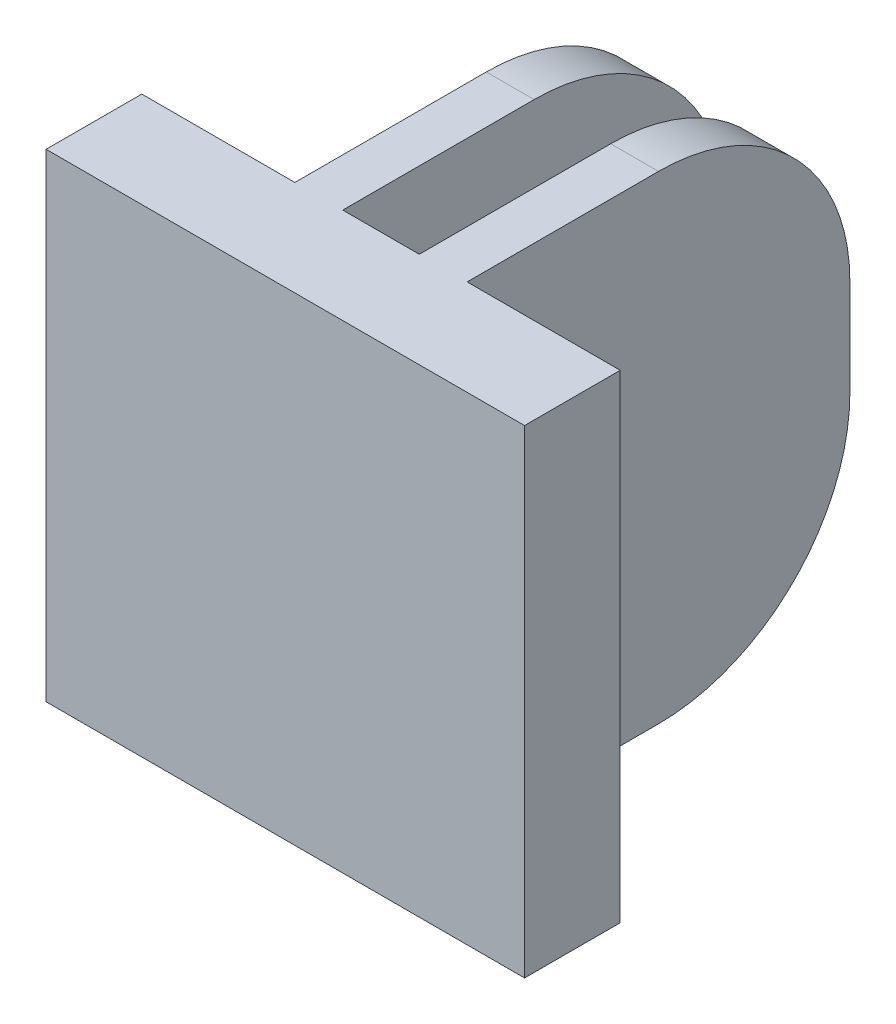
ISO-10303-21;
HEADER;
FILE_DESCRIPTION(('STEP AP214'),'2;1');
FILE_NAME('part.step','',(''),(''),'','','');
FILE_SCHEMA(('AUTOMOTIVE_DESIGN { 1 0 10303 214 1 1 1 1 }'));
ENDSEC;
DATA;
#1=APPLICATION_CONTEXT('core data for automotive mechanical design processes');
#2=APPLICATION_PROTOCOL_DEFINITION('international standard','automotive_design',2000,#1);
#3=PRODUCT_CONTEXT('',#1,'mechanical');
#4=PRODUCT('Part','Part','',(#3));
#5=PRODUCT_RELATED_PRODUCT_CATEGORY('part','',(#4));
#6=PRODUCT_DEFINITION_FORMATION('','',#4);
#7=PRODUCT_DEFINITION_CONTEXT('part definition',#1,'design');
#8=PRODUCT_DEFINITION('design','',#6,#7);
#9=PRODUCT_DEFINITION_SHAPE('','',#8);
#10=(LENGTH_UNIT() NAMED_UNIT(*) SI_UNIT(.MILLI.,.METRE.));
#11=(NAMED_UNIT(*) PLANE_ANGLE_UNIT() SI_UNIT($,.RADIAN.));
#12=(NAMED_UNIT(*) SI_UNIT($,.STERADIAN.) SOLID_ANGLE_UNIT());
#13=UNCERTAINTY_MEASURE_WITH_UNIT(LENGTH_MEASURE(1.E-05),#10,'distance_accuracy_value','');
#14=(GEOMETRIC_REPRESENTATION_CONTEXT(3) GLOBAL_UNCERTAINTY_ASSIGNED_CONTEXT((#13)) GLOBAL_UNIT_ASSIGNED_CONTEXT((#10,
#11,#12)) REPRESENTATION_CONTEXT('',''));
#15=CARTESIAN_POINT('',(0.,0.,0.));
#16=DIRECTION('',(0.,0.,1.));
#17=DIRECTION('',(1.,0.,0.));
#18=AXIS2_PLACEMENT_3D('',#15,#16,#17);
#19=CARTESIAN_POINT('',(-25.,25.,10.));
#20=DIRECTION('',(0.,-1.,0.));
#21=DIRECTION('',(0.,0.,-1.));
#22=AXIS2_PLACEMENT_3D('',#19,#20,#21);
#23=PLANE('',#22);
#24=DIRECTION('',(0.,0.,-1.));
#25=VECTOR('',#24,1.);
#26=CARTESIAN_POINT('',(-25.,25.,10.));
#27=LINE('',#26,#25);
#28=CARTESIAN_POINT('',(-25.,25.,10.));
#29=VERTEX_POINT('',#28);
#30=CARTESIAN_POINT('',(-25.,25.,0.));
#31=VERTEX_POINT('',#30);
#32=EDGE_CURVE('E251',#29,#31,#27,.T.);
#33=ORIENTED_EDGE('',*,*,#32,.F.);
#34=DIRECTION('',(-1.,0.,0.));
#35=VECTOR('',#34,1.);
#36=CARTESIAN_POINT('',(-25.,25.,10.));
#37=LINE('',#36,#35);
#38=CARTESIAN_POINT('',(25.,25.,10.));
#39=VERTEX_POINT('',#38);
#40=EDGE_CURVE('E225',#39,#29,#37,.T.);
#41=ORIENTED_EDGE('',*,*,#40,.F.);
#42=DIRECTION('',(0.,0.,-1.));
#43=VECTOR('',#42,1.);
#44=CARTESIAN_POINT('',(25.,25.,10.));
#45=LINE('',#44,#43);
#46=CARTESIAN_POINT('',(25.,25.,0.));
#47=VERTEX_POINT('',#46);
#48=EDGE_CURVE('E254',#39,#47,#45,.T.);
#49=ORIENTED_EDGE('',*,*,#48,.T.);
#50=DIRECTION('',(-1.,0.,0.));
#51=VECTOR('',#50,1.);
#52=CARTESIAN_POINT('',(-25.,25.,0.));
#53=LINE('',#52,#51);
#54=CARTESIAN_POINT('',(9.,25.,0.));
#55=VERTEX_POINT('',#54);
#56=EDGE_CURVE('E236',#47,#55,#53,.T.);
#57=ORIENTED_EDGE('',*,*,#56,.T.);
#58=DIRECTION('',(0.,0.,1.));
#59=VECTOR('',#58,1.);
#60=CARTESIAN_POINT('',(9.,25.,-40.));
#61=LINE('',#60,#59);
#62=CARTESIAN_POINT('',(9.,25.,-19.9999999999999));
#63=VERTEX_POINT('',#62);
#64=EDGE_CURVE('E214',#63,#55,#61,.T.);
#65=ORIENTED_EDGE('',*,*,#64,.F.);
#66=DIRECTION('',(1.,0.,0.));
#67=VECTOR('',#66,1.);
#68=CARTESIAN_POINT('',(-31.,25.,-19.9999999999999));
#69=LINE('',#68,#67);
#70=CARTESIAN_POINT('',(4.,25.,-19.9999999999999));
#71=VERTEX_POINT('',#70);
#72=EDGE_CURVE('E313',#71,#63,#69,.T.);
#73=ORIENTED_EDGE('',*,*,#72,.F.);
#74=DIRECTION('',(0.,0.,1.));
#75=VECTOR('',#74,1.);
#76=CARTESIAN_POINT('',(4.,25.,-40.));
#77=LINE('',#76,#75);
#78=CARTESIAN_POINT('',(4.,25.,0.));
#79=VERTEX_POINT('',#78);
#80=EDGE_CURVE('E218',#71,#79,#77,.T.);
#81=ORIENTED_EDGE('',*,*,#80,.T.);
#82=CARTESIAN_POINT('',(-4.,25.,0.));
#83=VERTEX_POINT('',#82);
#84=EDGE_CURVE('E240',#79,#83,#53,.T.);
#85=ORIENTED_EDGE('',*,*,#84,.T.);
#86=DIRECTION('',(0.,0.,1.));
#87=VECTOR('',#86,1.);
#88=CARTESIAN_POINT('',(-4.,25.,-40.));
#89=LINE('',#88,#87);
#90=CARTESIAN_POINT('',(-4.,25.,-19.9999999999999));
#91=VERTEX_POINT('',#90);
#92=EDGE_CURVE('E281',#91,#83,#89,.T.);
#93=ORIENTED_EDGE('',*,*,#92,.F.);
#94=CARTESIAN_POINT('',(-9.00000000000001,25.,-19.9999999999999));
#95=VERTEX_POINT('',#94);
#96=EDGE_CURVE('E351',#95,#91,#69,.T.);
#97=ORIENTED_EDGE('',*,*,#96,.F.);
#98=DIRECTION('',(0.,0.,1.));
#99=VECTOR('',#98,1.);
#100=CARTESIAN_POINT('',(-9.00000000000001,25.,-40.));
#101=LINE('',#100,#99);
#102=CARTESIAN_POINT('',(-9.00000000000001,25.,0.));
#103=VERTEX_POINT('',#102);
#104=EDGE_CURVE('E292',#95,#103,#101,.T.);
#105=ORIENTED_EDGE('',*,*,#104,.T.);
#106=EDGE_CURVE('E235',#103,#31,#53,.T.);
#107=ORIENTED_EDGE('',*,*,#106,.T.);
#108=EDGE_LOOP('',(#33,#41,#49,#57,#65,#73,#81,#85,#93,#97,#105,#107));
#109=FACE_BOUND('',#108,.T.);
#110=ADVANCED_FACE('F80',(#109),#23,.F.);
#111=CARTESIAN_POINT('',(9.,-25.,-40.));
#112=DIRECTION('',(-1.,0.,0.));
#113=DIRECTION('',(0.,0.,1.));
#114=AXIS2_PLACEMENT_3D('',#111,#112,#113);
#115=PLANE('',#114);
#116=CARTESIAN_POINT('',(9.,5.,-20.));
#117=DIRECTION('',(1.,0.,0.));
#118=DIRECTION('',(0.,0.,1.));
#119=AXIS2_PLACEMENT_3D('',#116,#117,#118);
#120=CIRCLE('',#119,20.);
#121=CARTESIAN_POINT('',(9.,5.,-40.));
#122=VERTEX_POINT('',#121);
#123=EDGE_CURVE('E103',#122,#63,#120,.T.);
#124=ORIENTED_EDGE('',*,*,#123,.T.);
#125=ORIENTED_EDGE('',*,*,#64,.T.);
#126=DIRECTION('',(0.,-1.,0.));
#127=VECTOR('',#126,1.);
#128=CARTESIAN_POINT('',(9.,-25.,0.));
#129=LINE('',#128,#127);
#130=CARTESIAN_POINT('',(9.,-25.,0.));
#131=VERTEX_POINT('',#130);
#132=EDGE_CURVE('E213',#55,#131,#129,.T.);
#133=ORIENTED_EDGE('',*,*,#132,.T.);
#134=DIRECTION('',(0.,0.,1.));
#135=VECTOR('',#134,1.);
#136=CARTESIAN_POINT('',(9.,-25.,-40.));
#137=LINE('',#136,#135);
#138=CARTESIAN_POINT('',(9.,-25.,-19.9999999999999));
#139=VERTEX_POINT('',#138);
#140=EDGE_CURVE('E204',#139,#131,#137,.T.);
#141=ORIENTED_EDGE('',*,*,#140,.F.);
#142=CARTESIAN_POINT('',(9.,-5.,-20.));
#143=DIRECTION('',(1.,0.,0.));
#144=DIRECTION('',(0.,0.,1.));
#145=AXIS2_PLACEMENT_3D('',#142,#143,#144);
#146=CIRCLE('',#145,20.);
#147=CARTESIAN_POINT('',(9.,-4.99999999999986,-40.));
#148=VERTEX_POINT('',#147);
#149=EDGE_CURVE('E191',#139,#148,#146,.T.);
#150=ORIENTED_EDGE('',*,*,#149,.T.);
#151=DIRECTION('',(0.,-1.,0.));
#152=VECTOR('',#151,1.);
#153=CARTESIAN_POINT('',(9.,-25.,-40.));
#154=LINE('',#153,#152);
#155=EDGE_CURVE('E297',#122,#148,#154,.T.);
#156=ORIENTED_EDGE('',*,*,#155,.F.);
#157=EDGE_LOOP('',(#124,#125,#133,#141,#150,#156));
#158=FACE_BOUND('',#157,.T.);
#159=ADVANCED_FACE('F211',(#158),#115,.F.);
#160=CARTESIAN_POINT('',(4.,25.,-40.));
#161=DIRECTION('',(1.,0.,0.));
#162=DIRECTION('',(0.,1.,0.));
#163=AXIS2_PLACEMENT_3D('',#160,#161,#162);
#164=PLANE('',#163);
#165=CARTESIAN_POINT('',(4.,5.,-20.));
#166=DIRECTION('',(1.,0.,0.));
#167=DIRECTION('',(0.,1.,0.));
#168=AXIS2_PLACEMENT_3D('',#165,#166,#167);
#169=CIRCLE('',#168,20.);
#170=CARTESIAN_POINT('',(4.,4.99999999999986,-40.));
#171=VERTEX_POINT('',#170);
#172=EDGE_CURVE('E287',#171,#71,#169,.T.);
#173=ORIENTED_EDGE('',*,*,#172,.F.);
#174=DIRECTION('',(0.,1.,0.));
#175=VECTOR('',#174,1.);
#176=CARTESIAN_POINT('',(4.,25.,-40.));
#177=LINE('',#176,#175);
#178=CARTESIAN_POINT('',(4.,-5.,-40.));
#179=VERTEX_POINT('',#178);
#180=EDGE_CURVE('E299',#179,#171,#177,.T.);
#181=ORIENTED_EDGE('',*,*,#180,.F.);
#182=CARTESIAN_POINT('',(4.,-5.,-20.));
#183=DIRECTION('',(1.,0.,0.));
#184=DIRECTION('',(0.,1.,0.));
#185=AXIS2_PLACEMENT_3D('',#182,#183,#184);
#186=CIRCLE('',#185,20.);
#187=CARTESIAN_POINT('',(4.,-25.,-19.9999999999999));
#188=VERTEX_POINT('',#187);
#189=EDGE_CURVE('E95',#188,#179,#186,.T.);
#190=ORIENTED_EDGE('',*,*,#189,.F.);
#191=DIRECTION('',(0.,0.,1.));
#192=VECTOR('',#191,1.);
#193=CARTESIAN_POINT('',(4.,-25.,-40.));
#194=LINE('',#193,#192);
#195=CARTESIAN_POINT('',(4.,-25.,0.));
#196=VERTEX_POINT('',#195);
#197=EDGE_CURVE('E207',#188,#196,#194,.T.);
#198=ORIENTED_EDGE('',*,*,#197,.T.);
#199=DIRECTION('',(0.,1.,0.));
#200=VECTOR('',#199,1.);
#201=CARTESIAN_POINT('',(4.,25.,0.));
#202=LINE('',#201,#200);
#203=EDGE_CURVE('E300',#196,#79,#202,.T.);
#204=ORIENTED_EDGE('',*,*,#203,.T.);
#205=ORIENTED_EDGE('',*,*,#80,.F.);
#206=EDGE_LOOP('',(#173,#181,#190,#198,#204,#205));
#207=FACE_BOUND('',#206,.T.);
#208=ADVANCED_FACE('F321',(#207),#164,.F.);
#209=CARTESIAN_POINT('',(0.,0.,-40.));
#210=DIRECTION('',(0.,0.,1.));
#211=DIRECTION('',(1.,0.,0.));
#212=AXIS2_PLACEMENT_3D('',#209,#210,#211);
#213=PLANE('',#212);
#214=ORIENTED_EDGE('',*,*,#180,.T.);
#215=DIRECTION('',(1.,0.,0.));
#216=VECTOR('',#215,1.);
#217=CARTESIAN_POINT('',(-31.,4.99999999999986,-40.));
#218=LINE('',#217,#216);
#219=EDGE_CURVE('E347',#171,#122,#218,.T.);
#220=ORIENTED_EDGE('',*,*,#219,.T.);
#221=ORIENTED_EDGE('',*,*,#155,.T.);
#222=DIRECTION('',(1.,0.,0.));
#223=VECTOR('',#222,1.);
#224=CARTESIAN_POINT('',(-31.,-4.99999999999986,-40.));
#225=LINE('',#224,#223);
#226=EDGE_CURVE('E195',#179,#148,#225,.T.);
#227=ORIENTED_EDGE('',*,*,#226,.F.);
#228=EDGE_LOOP('',(#214,#220,#221,#227));
#229=FACE_BOUND('',#228,.T.);
#230=ADVANCED_FACE('F359',(#229),#213,.F.);
#231=CARTESIAN_POINT('',(-4.,25.,-40.));
#232=DIRECTION('',(-1.,0.,0.));
#233=DIRECTION('',(0.,-1.,0.));
#234=AXIS2_PLACEMENT_3D('',#231,#232,#233);
#235=PLANE('',#234);
#236=CARTESIAN_POINT('',(-4.,5.,-20.));
#237=DIRECTION('',(-1.,0.,0.));
#238=DIRECTION('',(0.,-1.,0.));
#239=AXIS2_PLACEMENT_3D('',#236,#237,#238);
#240=CIRCLE('',#239,20.);
#241=CARTESIAN_POINT('',(-4.,5.,-40.));
#242=VERTEX_POINT('',#241);
#243=EDGE_CURVE('E355',#91,#242,#240,.T.);
#244=ORIENTED_EDGE('',*,*,#243,.F.);
#245=ORIENTED_EDGE('',*,*,#92,.T.);
#246=DIRECTION('',(0.,-1.,0.));
#247=VECTOR('',#246,1.);
#248=CARTESIAN_POINT('',(-4.,25.,0.));
#249=LINE('',#248,#247);
#250=CARTESIAN_POINT('',(-4.,-25.,0.));
#251=VERTEX_POINT('',#250);
#252=EDGE_CURVE('E284',#83,#251,#249,.T.);
#253=ORIENTED_EDGE('',*,*,#252,.T.);
#254=DIRECTION('',(0.,0.,1.));
#255=VECTOR('',#254,1.);
#256=CARTESIAN_POINT('',(-4.,-25.,-40.));
#257=LINE('',#256,#255);
#258=CARTESIAN_POINT('',(-4.,-25.,-19.9999999999999));
#259=VERTEX_POINT('',#258);
#260=EDGE_CURVE('E275',#259,#251,#257,.T.);
#261=ORIENTED_EDGE('',*,*,#260,.F.);
#262=CARTESIAN_POINT('',(-4.,-5.,-20.));
#263=DIRECTION('',(-1.,0.,0.));
#264=DIRECTION('',(0.,-1.,0.));
#265=AXIS2_PLACEMENT_3D('',#262,#263,#264);
#266=CIRCLE('',#265,20.);
#267=CARTESIAN_POINT('',(-4.,-4.99999999999986,-40.));
#268=VERTEX_POINT('',#267);
#269=EDGE_CURVE('E260',#268,#259,#266,.T.);
#270=ORIENTED_EDGE('',*,*,#269,.F.);
#271=DIRECTION('',(0.,-1.,0.));
#272=VECTOR('',#271,1.);
#273=CARTESIAN_POINT('',(-4.,25.,-40.));
#274=LINE('',#273,#272);
#275=EDGE_CURVE('E273',#242,#268,#274,.T.);
#276=ORIENTED_EDGE('',*,*,#275,.F.);
#277=EDGE_LOOP('',(#244,#245,#253,#261,#270,#276));
#278=FACE_BOUND('',#277,.T.);
#279=ADVANCED_FACE('F272',(#278),#235,.F.);
#280=CARTESIAN_POINT('',(-9.,-25.,-40.));
#281=DIRECTION('',(1.,0.,0.));
#282=DIRECTION('',(0.,1.,0.));
#283=AXIS2_PLACEMENT_3D('',#280,#281,#282);
#284=PLANE('',#283);
#285=CARTESIAN_POINT('',(-9.,5.,-20.));
#286=DIRECTION('',(1.,0.,0.));
#287=DIRECTION('',(0.,1.,0.));
#288=AXIS2_PLACEMENT_3D('',#285,#286,#287);
#289=CIRCLE('',#288,20.);
#290=CARTESIAN_POINT('',(-9.,4.99999999999986,-40.));
#291=VERTEX_POINT('',#290);
#292=EDGE_CURVE('E354',#291,#95,#289,.T.);
#293=ORIENTED_EDGE('',*,*,#292,.F.);
#294=DIRECTION('',(0.,1.,0.));
#295=VECTOR('',#294,1.);
#296=CARTESIAN_POINT('',(-9.,-25.,-40.));
#297=LINE('',#296,#295);
#298=CARTESIAN_POINT('',(-9.,-5.,-40.));
#299=VERTEX_POINT('',#298);
#300=EDGE_CURVE('E278',#299,#291,#297,.T.);
#301=ORIENTED_EDGE('',*,*,#300,.F.);
#302=CARTESIAN_POINT('',(-9.,-5.,-20.));
#303=DIRECTION('',(1.,0.,0.));
#304=DIRECTION('',(0.,1.,0.));
#305=AXIS2_PLACEMENT_3D('',#302,#303,#304);
#306=CIRCLE('',#305,20.);
#307=CARTESIAN_POINT('',(-9.,-25.,-19.9999999999999));
#308=VERTEX_POINT('',#307);
#309=EDGE_CURVE('E263',#308,#299,#306,.T.);
#310=ORIENTED_EDGE('',*,*,#309,.F.);
#311=DIRECTION('',(0.,0.,1.));
#312=VECTOR('',#311,1.);
#313=CARTESIAN_POINT('',(-9.,-25.,-40.));
#314=LINE('',#313,#312);
#315=CARTESIAN_POINT('',(-9.,-25.,0.));
#316=VERTEX_POINT('',#315);
#317=EDGE_CURVE('E294',#308,#316,#314,.T.);
#318=ORIENTED_EDGE('',*,*,#317,.T.);
#319=DIRECTION('',(0.,1.,0.));
#320=VECTOR('',#319,1.);
#321=CARTESIAN_POINT('',(-9.,-25.,0.));
#322=LINE('',#321,#320);
#323=EDGE_CURVE('E279',#316,#103,#322,.T.);
#324=ORIENTED_EDGE('',*,*,#323,.T.);
#325=ORIENTED_EDGE('',*,*,#104,.F.);
#326=EDGE_LOOP('',(#293,#301,#310,#318,#324,#325));
#327=FACE_BOUND('',#326,.T.);
#328=ADVANCED_FACE('F346',(#327),#284,.F.);
#329=CARTESIAN_POINT('',(0.,0.,-40.));
#330=DIRECTION('',(0.,0.,-1.));
#331=DIRECTION('',(-1.,0.,0.));
#332=AXIS2_PLACEMENT_3D('',#329,#330,#331);
#333=PLANE('',#332);
#334=ORIENTED_EDGE('',*,*,#300,.T.);
#335=DIRECTION('',(1.,0.,0.));
#336=VECTOR('',#335,1.);
#337=CARTESIAN_POINT('',(-31.,5.,-40.));
#338=LINE('',#337,#336);
#339=EDGE_CURVE('E12',#291,#242,#338,.T.);
#340=ORIENTED_EDGE('',*,*,#339,.T.);
#341=ORIENTED_EDGE('',*,*,#275,.T.);
#342=DIRECTION('',(1.,0.,0.));
#343=VECTOR('',#342,1.);
#344=CARTESIAN_POINT('',(-31.,-5.,-40.));
#345=LINE('',#344,#343);
#346=EDGE_CURVE('E88',#299,#268,#345,.T.);
#347=ORIENTED_EDGE('',*,*,#346,.F.);
#348=EDGE_LOOP('',(#334,#340,#341,#347));
#349=FACE_BOUND('',#348,.T.);
#350=ADVANCED_FACE('F277',(#349),#333,.T.);
#351=CARTESIAN_POINT('',(0.,0.,0.));
#352=DIRECTION('',(0.,0.,-1.));
#353=DIRECTION('',(-1.,0.,0.));
#354=AXIS2_PLACEMENT_3D('',#351,#352,#353);
#355=PLANE('',#354);
#356=DIRECTION('',(1.,0.,0.));
#357=VECTOR('',#356,1.);
#358=CARTESIAN_POINT('',(-25.,-25.,0.));
#359=LINE('',#358,#357);
#360=EDGE_CURVE('E245',#251,#196,#359,.T.);
#361=ORIENTED_EDGE('',*,*,#360,.F.);
#362=ORIENTED_EDGE('',*,*,#252,.F.);
#363=ORIENTED_EDGE('',*,*,#84,.F.);
#364=ORIENTED_EDGE('',*,*,#203,.F.);
#365=EDGE_LOOP('',(#361,#362,#363,#364));
#366=FACE_BOUND('',#365,.T.);
#367=ADVANCED_FACE('F320',(#366),#355,.T.);
#368=ORIENTED_EDGE('',*,*,#106,.F.);
#369=ORIENTED_EDGE('',*,*,#323,.F.);
#370=CARTESIAN_POINT('',(-25.,-25.,0.));
#371=VERTEX_POINT('',#370);
#372=EDGE_CURVE('E226',#371,#316,#359,.T.);
#373=ORIENTED_EDGE('',*,*,#372,.F.);
#374=DIRECTION('',(0.,-1.,0.));
#375=VECTOR('',#374,1.);
#376=CARTESIAN_POINT('',(-25.,-25.,0.));
#377=LINE('',#376,#375);
#378=EDGE_CURVE('E239',#31,#371,#377,.T.);
#379=ORIENTED_EDGE('',*,*,#378,.F.);
#380=EDGE_LOOP('',(#368,#369,#373,#379));
#381=FACE_BOUND('',#380,.T.);
#382=ADVANCED_FACE('F342',(#381),#355,.T.);
#383=CARTESIAN_POINT('',(25.,-25.,10.));
#384=DIRECTION('',(-1.,0.,0.));
#385=DIRECTION('',(0.,0.,1.));
#386=AXIS2_PLACEMENT_3D('',#383,#384,#385);
#387=PLANE('',#386);
#388=DIRECTION('',(0.,1.,0.));
#389=VECTOR('',#388,1.);
#390=CARTESIAN_POINT('',(25.,-25.,0.));
#391=LINE('',#390,#389);
#392=CARTESIAN_POINT('',(25.,-25.,0.));
#393=VERTEX_POINT('',#392);
#394=EDGE_CURVE('E216',#393,#47,#391,.T.);
#395=ORIENTED_EDGE('',*,*,#394,.T.);
#396=ORIENTED_EDGE('',*,*,#48,.F.);
#397=DIRECTION('',(0.,1.,0.));
#398=VECTOR('',#397,1.);
#399=CARTESIAN_POINT('',(25.,-25.,10.));
#400=LINE('',#399,#398);
#401=CARTESIAN_POINT('',(25.,-25.,10.));
#402=VERTEX_POINT('',#401);
#403=EDGE_CURVE('E222',#402,#39,#400,.T.);
#404=ORIENTED_EDGE('',*,*,#403,.F.);
#405=DIRECTION('',(0.,0.,-1.));
#406=VECTOR('',#405,1.);
#407=CARTESIAN_POINT('',(25.,-25.,10.));
#408=LINE('',#407,#406);
#409=EDGE_CURVE('E232',#402,#393,#408,.T.);
#410=ORIENTED_EDGE('',*,*,#409,.T.);
#411=EDGE_LOOP('',(#395,#396,#404,#410));
#412=FACE_BOUND('',#411,.T.);
#413=ADVANCED_FACE('F82',(#412),#387,.F.);
#414=CARTESIAN_POINT('',(-25.,-25.,10.));
#415=DIRECTION('',(1.,0.,0.));
#416=DIRECTION('',(0.,0.,-1.));
#417=AXIS2_PLACEMENT_3D('',#414,#415,#416);
#418=PLANE('',#417);
#419=ORIENTED_EDGE('',*,*,#378,.T.);
#420=DIRECTION('',(0.,0.,-1.));
#421=VECTOR('',#420,1.);
#422=CARTESIAN_POINT('',(-25.,-25.,10.));
#423=LINE('',#422,#421);
#424=CARTESIAN_POINT('',(-25.,-25.,10.));
#425=VERTEX_POINT('',#424);
#426=EDGE_CURVE('E248',#425,#371,#423,.T.);
#427=ORIENTED_EDGE('',*,*,#426,.F.);
#428=DIRECTION('',(0.,-1.,0.));
#429=VECTOR('',#428,1.);
#430=CARTESIAN_POINT('',(-25.,-25.,10.));
#431=LINE('',#430,#429);
#432=EDGE_CURVE('E228',#29,#425,#431,.T.);
#433=ORIENTED_EDGE('',*,*,#432,.F.);
#434=ORIENTED_EDGE('',*,*,#32,.T.);
#435=EDGE_LOOP('',(#419,#427,#433,#434));
#436=FACE_BOUND('',#435,.T.);
#437=ADVANCED_FACE('F364',(#436),#418,.F.);
#438=CARTESIAN_POINT('',(-25.,-25.,10.));
#439=DIRECTION('',(0.,1.,0.));
#440=DIRECTION('',(0.,0.,1.));
#441=AXIS2_PLACEMENT_3D('',#438,#439,#440);
#442=PLANE('',#441);
#443=ORIENTED_EDGE('',*,*,#140,.T.);
#444=EDGE_CURVE('E242',#131,#393,#359,.T.);
#445=ORIENTED_EDGE('',*,*,#444,.T.);
#446=ORIENTED_EDGE('',*,*,#409,.F.);
#447=DIRECTION('',(1.,0.,0.));
#448=VECTOR('',#447,1.);
#449=CARTESIAN_POINT('',(-25.,-25.,10.));
#450=LINE('',#449,#448);
#451=EDGE_CURVE('E230',#425,#402,#450,.T.);
#452=ORIENTED_EDGE('',*,*,#451,.F.);
#453=ORIENTED_EDGE('',*,*,#426,.T.);
#454=ORIENTED_EDGE('',*,*,#372,.T.);
#455=ORIENTED_EDGE('',*,*,#317,.F.);
#456=DIRECTION('',(1.,0.,0.));
#457=VECTOR('',#456,1.);
#458=CARTESIAN_POINT('',(-31.,-25.,-19.9999999999999));
#459=LINE('',#458,#457);
#460=EDGE_CURVE('E208',#308,#259,#459,.T.);
#461=ORIENTED_EDGE('',*,*,#460,.T.);
#462=ORIENTED_EDGE('',*,*,#260,.T.);
#463=ORIENTED_EDGE('',*,*,#360,.T.);
#464=ORIENTED_EDGE('',*,*,#197,.F.);
#465=EDGE_CURVE('E194',#188,#139,#459,.T.);
#466=ORIENTED_EDGE('',*,*,#465,.T.);
#467=EDGE_LOOP('',(#443,#445,#446,#452,#453,#454,#455,#461,#462,#463,#464,#466));
#468=FACE_BOUND('',#467,.T.);
#469=ADVANCED_FACE('F203',(#468),#442,.F.);
#470=CARTESIAN_POINT('',(0.,0.,10.));
#471=DIRECTION('',(0.,0.,-1.));
#472=DIRECTION('',(-1.,0.,0.));
#473=AXIS2_PLACEMENT_3D('',#470,#471,#472);
#474=PLANE('',#473);
#475=ORIENTED_EDGE('',*,*,#451,.T.);
#476=ORIENTED_EDGE('',*,*,#403,.T.);
#477=ORIENTED_EDGE('',*,*,#40,.T.);
#478=ORIENTED_EDGE('',*,*,#432,.T.);
#479=EDGE_LOOP('',(#475,#476,#477,#478));
#480=FACE_BOUND('',#479,.T.);
#481=ADVANCED_FACE('F333',(#480),#474,.F.);
#482=ORIENTED_EDGE('',*,*,#132,.F.);
#483=ORIENTED_EDGE('',*,*,#56,.F.);
#484=ORIENTED_EDGE('',*,*,#394,.F.);
#485=ORIENTED_EDGE('',*,*,#444,.F.);
#486=EDGE_LOOP('',(#482,#483,#484,#485));
#487=FACE_BOUND('',#486,.T.);
#488=ADVANCED_FACE('F330',(#487),#355,.T.);
#489=CARTESIAN_POINT('',(-31.,-5.,-20.));
#490=DIRECTION('',(1.,0.,0.));
#491=DIRECTION('',(0.,0.,-1.));
#492=AXIS2_PLACEMENT_3D('',#489,#490,#491);
#493=CYLINDRICAL_SURFACE('',#492,20.);
#494=ORIENTED_EDGE('',*,*,#269,.T.);
#495=ORIENTED_EDGE('',*,*,#460,.F.);
#496=ORIENTED_EDGE('',*,*,#309,.T.);
#497=ORIENTED_EDGE('',*,*,#346,.T.);
#498=EDGE_LOOP('',(#494,#495,#496,#497));
#499=FACE_BOUND('',#498,.T.);
#500=ADVANCED_FACE('F259',(#499),#493,.T.);
#501=CARTESIAN_POINT('',(-31.,5.,-20.));
#502=DIRECTION('',(1.,0.,0.));
#503=DIRECTION('',(0.,0.,-1.));
#504=AXIS2_PLACEMENT_3D('',#501,#502,#503);
#505=CYLINDRICAL_SURFACE('',#504,20.);
#506=ORIENTED_EDGE('',*,*,#243,.T.);
#507=ORIENTED_EDGE('',*,*,#339,.F.);
#508=ORIENTED_EDGE('',*,*,#292,.T.);
#509=ORIENTED_EDGE('',*,*,#96,.T.);
#510=EDGE_LOOP('',(#506,#507,#508,#509));
#511=FACE_BOUND('',#510,.T.);
#512=ADVANCED_FACE('F363',(#511),#505,.T.);
#513=ORIENTED_EDGE('',*,*,#189,.T.);
#514=ORIENTED_EDGE('',*,*,#226,.T.);
#515=ORIENTED_EDGE('',*,*,#149,.F.);
#516=ORIENTED_EDGE('',*,*,#465,.F.);
#517=EDGE_LOOP('',(#513,#514,#515,#516));
#518=FACE_BOUND('',#517,.T.);
#519=ADVANCED_FACE('F193',(#518),#493,.T.);
#520=ORIENTED_EDGE('',*,*,#172,.T.);
#521=ORIENTED_EDGE('',*,*,#72,.T.);
#522=ORIENTED_EDGE('',*,*,#123,.F.);
#523=ORIENTED_EDGE('',*,*,#219,.F.);
#524=EDGE_LOOP('',(#520,#521,#522,#523));
#525=FACE_BOUND('',#524,.T.);
#526=ADVANCED_FACE('F357',(#525),#505,.T.);
#527=CLOSED_SHELL('',(#110,#159,#208,#230,#279,#328,#350,#367,#382,#413,#437,#469,#481,#488,
#500,#512,#519,#526));
#528=MANIFOLD_SOLID_BREP('B2',#527);
#529=ADVANCED_BREP_SHAPE_REPRESENTATION('',(#18,#528),#14);
#530=SHAPE_DEFINITION_REPRESENTATION(#9,#529);
ENDSEC;
END-ISO-10303-21;
